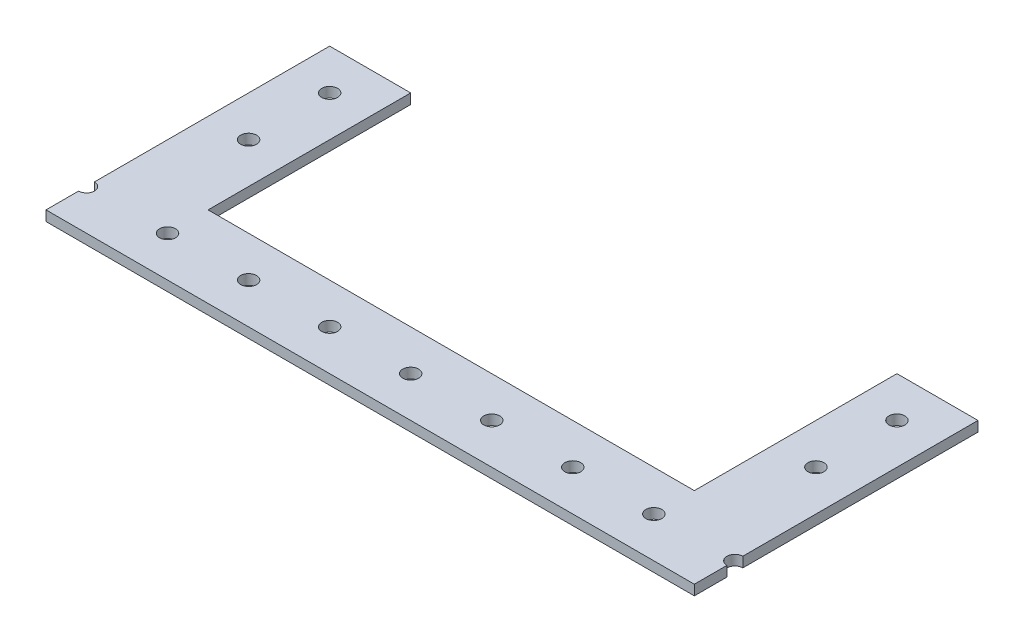
ISO-10303-21;
HEADER;
FILE_DESCRIPTION(('STEP AP214'),'2;1');
FILE_NAME('part.step','',(''),(''),'','','');
FILE_SCHEMA(('AUTOMOTIVE_DESIGN { 1 0 10303 214 1 1 1 1 }'));
ENDSEC;
DATA;
#1=APPLICATION_CONTEXT('core data for automotive mechanical design processes');
#2=APPLICATION_PROTOCOL_DEFINITION('international standard','automotive_design',2000,#1);
#3=PRODUCT_CONTEXT('',#1,'mechanical');
#4=PRODUCT('Part','Part','',(#3));
#5=PRODUCT_RELATED_PRODUCT_CATEGORY('part','',(#4));
#6=PRODUCT_DEFINITION_FORMATION('','',#4);
#7=PRODUCT_DEFINITION_CONTEXT('part definition',#1,'design');
#8=PRODUCT_DEFINITION('design','',#6,#7);
#9=PRODUCT_DEFINITION_SHAPE('','',#8);
#10=(LENGTH_UNIT() NAMED_UNIT(*) SI_UNIT(.MILLI.,.METRE.));
#11=(NAMED_UNIT(*) PLANE_ANGLE_UNIT() SI_UNIT($,.RADIAN.));
#12=(NAMED_UNIT(*) SI_UNIT($,.STERADIAN.) SOLID_ANGLE_UNIT());
#13=UNCERTAINTY_MEASURE_WITH_UNIT(LENGTH_MEASURE(1.E-05),#10,'distance_accuracy_value','');
#14=(GEOMETRIC_REPRESENTATION_CONTEXT(3) GLOBAL_UNCERTAINTY_ASSIGNED_CONTEXT((#13)) GLOBAL_UNIT_ASSIGNED_CONTEXT((#10,
#11,#12)) REPRESENTATION_CONTEXT('',''));
#15=CARTESIAN_POINT('',(0.,0.,0.));
#16=DIRECTION('',(0.,0.,1.));
#17=DIRECTION('',(1.,0.,0.));
#18=AXIS2_PLACEMENT_3D('',#15,#16,#17);
#19=CARTESIAN_POINT('',(101.6,3.175,-12.7));
#20=DIRECTION('',(0.,-1.,0.));
#21=DIRECTION('',(0.,0.,-1.));
#22=AXIS2_PLACEMENT_3D('',#19,#20,#21);
#23=CYLINDRICAL_SURFACE('',#22,2.48920000000003);
#24=CARTESIAN_POINT('',(101.6,0.,-12.7));
#25=DIRECTION('',(0.,1.,0.));
#26=DIRECTION('',(0.,0.,1.));
#27=AXIS2_PLACEMENT_3D('',#24,#25,#26);
#28=CIRCLE('',#27,2.48920000000003);
#29=CARTESIAN_POINT('',(101.6,0.,-15.1892));
#30=VERTEX_POINT('',#29);
#31=CARTESIAN_POINT('',(101.6,0.,-10.2108));
#32=VERTEX_POINT('',#31);
#33=EDGE_CURVE('E176',#30,#32,#28,.T.);
#34=ORIENTED_EDGE('',*,*,#33,.F.);
#35=DIRECTION('',(0.,-1.,0.));
#36=VECTOR('',#35,1.);
#37=CARTESIAN_POINT('',(101.6,3.175,-15.1892));
#38=LINE('',#37,#36);
#39=CARTESIAN_POINT('',(101.6,3.175,-15.1892));
#40=VERTEX_POINT('',#39);
#41=EDGE_CURVE('E11',#40,#30,#38,.T.);
#42=ORIENTED_EDGE('',*,*,#41,.F.);
#43=CARTESIAN_POINT('',(101.6,3.175,-12.7));
#44=DIRECTION('',(0.,1.,0.));
#45=DIRECTION('',(0.,0.,1.));
#46=AXIS2_PLACEMENT_3D('',#43,#44,#45);
#47=CIRCLE('',#46,2.48920000000003);
#48=CARTESIAN_POINT('',(101.6,3.175,-10.2108));
#49=VERTEX_POINT('',#48);
#50=EDGE_CURVE('E221',#40,#49,#47,.T.);
#51=ORIENTED_EDGE('',*,*,#50,.T.);
#52=DIRECTION('',(0.,-1.,0.));
#53=VECTOR('',#52,1.);
#54=CARTESIAN_POINT('',(101.6,3.175,-10.2108));
#55=LINE('',#54,#53);
#56=EDGE_CURVE('E99',#49,#32,#55,.T.);
#57=ORIENTED_EDGE('',*,*,#56,.T.);
#58=EDGE_LOOP('',(#34,#42,#51,#57));
#59=FACE_BOUND('',#58,.T.);
#60=ADVANCED_FACE('F36',(#59),#23,.F.);
#61=CARTESIAN_POINT('',(101.6,3.175,0.));
#62=DIRECTION('',(-1.,0.,0.));
#63=DIRECTION('',(0.,0.,1.));
#64=AXIS2_PLACEMENT_3D('',#61,#62,#63);
#65=PLANE('',#64);
#66=DIRECTION('',(0.,0.,-1.));
#67=VECTOR('',#66,1.);
#68=CARTESIAN_POINT('',(101.6,0.,0.));
#69=LINE('',#68,#67);
#70=CARTESIAN_POINT('',(101.6,0.,-88.9));
#71=VERTEX_POINT('',#70);
#72=EDGE_CURVE('E179',#30,#71,#69,.T.);
#73=ORIENTED_EDGE('',*,*,#72,.T.);
#74=DIRECTION('',(0.,-1.,0.));
#75=VECTOR('',#74,1.);
#76=CARTESIAN_POINT('',(101.6,3.175,-88.9));
#77=LINE('',#76,#75);
#78=CARTESIAN_POINT('',(101.6,3.175,-88.9));
#79=VERTEX_POINT('',#78);
#80=EDGE_CURVE('E44',#79,#71,#77,.T.);
#81=ORIENTED_EDGE('',*,*,#80,.F.);
#82=DIRECTION('',(0.,0.,-1.));
#83=VECTOR('',#82,1.);
#84=CARTESIAN_POINT('',(101.6,3.175,0.));
#85=LINE('',#84,#83);
#86=EDGE_CURVE('E153',#40,#79,#85,.T.);
#87=ORIENTED_EDGE('',*,*,#86,.F.);
#88=ORIENTED_EDGE('',*,*,#41,.T.);
#89=EDGE_LOOP('',(#73,#81,#87,#88));
#90=FACE_BOUND('',#89,.T.);
#91=ADVANCED_FACE('F288',(#90),#65,.F.);
#92=CARTESIAN_POINT('',(0.,3.175,-88.9));
#93=DIRECTION('',(0.,0.,1.));
#94=DIRECTION('',(1.,0.,0.));
#95=AXIS2_PLACEMENT_3D('',#92,#93,#94);
#96=PLANE('',#95);
#97=DIRECTION('',(-1.,0.,0.));
#98=VECTOR('',#97,1.);
#99=CARTESIAN_POINT('',(0.,0.,-88.9));
#100=LINE('',#99,#98);
#101=CARTESIAN_POINT('',(76.2,0.,-88.9));
#102=VERTEX_POINT('',#101);
#103=EDGE_CURVE('E182',#71,#102,#100,.T.);
#104=ORIENTED_EDGE('',*,*,#103,.T.);
#105=DIRECTION('',(0.,-1.,0.));
#106=VECTOR('',#105,1.);
#107=CARTESIAN_POINT('',(76.2,3.175,-88.9));
#108=LINE('',#107,#106);
#109=CARTESIAN_POINT('',(76.2,3.175,-88.9));
#110=VERTEX_POINT('',#109);
#111=EDGE_CURVE('E239',#110,#102,#108,.T.);
#112=ORIENTED_EDGE('',*,*,#111,.F.);
#113=DIRECTION('',(-1.,0.,0.));
#114=VECTOR('',#113,1.);
#115=CARTESIAN_POINT('',(0.,3.175,-88.9));
#116=LINE('',#115,#114);
#117=EDGE_CURVE('E248',#79,#110,#116,.T.);
#118=ORIENTED_EDGE('',*,*,#117,.F.);
#119=ORIENTED_EDGE('',*,*,#80,.T.);
#120=EDGE_LOOP('',(#104,#112,#118,#119));
#121=FACE_BOUND('',#120,.T.);
#122=ADVANCED_FACE('F246',(#121),#96,.F.);
#123=CARTESIAN_POINT('',(76.2,3.175,0.));
#124=DIRECTION('',(1.,0.,0.));
#125=DIRECTION('',(0.,0.,-1.));
#126=AXIS2_PLACEMENT_3D('',#123,#124,#125);
#127=PLANE('',#126);
#128=DIRECTION('',(0.,0.,1.));
#129=VECTOR('',#128,1.);
#130=CARTESIAN_POINT('',(76.2,0.,0.));
#131=LINE('',#130,#129);
#132=CARTESIAN_POINT('',(76.2,0.,-25.4));
#133=VERTEX_POINT('',#132);
#134=EDGE_CURVE('E185',#102,#133,#131,.T.);
#135=ORIENTED_EDGE('',*,*,#134,.T.);
#136=DIRECTION('',(0.,-1.,0.));
#137=VECTOR('',#136,1.);
#138=CARTESIAN_POINT('',(76.2,3.175,-25.4));
#139=LINE('',#138,#137);
#140=CARTESIAN_POINT('',(76.2,3.175,-25.4));
#141=VERTEX_POINT('',#140);
#142=EDGE_CURVE('E236',#141,#133,#139,.T.);
#143=ORIENTED_EDGE('',*,*,#142,.F.);
#144=DIRECTION('',(0.,0.,1.));
#145=VECTOR('',#144,1.);
#146=CARTESIAN_POINT('',(76.2,3.175,0.));
#147=LINE('',#146,#145);
#148=EDGE_CURVE('E268',#110,#141,#147,.T.);
#149=ORIENTED_EDGE('',*,*,#148,.F.);
#150=ORIENTED_EDGE('',*,*,#111,.T.);
#151=EDGE_LOOP('',(#135,#143,#149,#150));
#152=FACE_BOUND('',#151,.T.);
#153=ADVANCED_FACE('F259',(#152),#127,.F.);
#154=CARTESIAN_POINT('',(0.,3.175,-25.4));
#155=DIRECTION('',(0.,0.,1.));
#156=DIRECTION('',(1.,0.,0.));
#157=AXIS2_PLACEMENT_3D('',#154,#155,#156);
#158=PLANE('',#157);
#159=DIRECTION('',(-1.,0.,0.));
#160=VECTOR('',#159,1.);
#161=CARTESIAN_POINT('',(0.,0.,-25.4));
#162=LINE('',#161,#160);
#163=CARTESIAN_POINT('',(-76.2,0.,-25.4));
#164=VERTEX_POINT('',#163);
#165=EDGE_CURVE('E187',#133,#164,#162,.T.);
#166=ORIENTED_EDGE('',*,*,#165,.T.);
#167=DIRECTION('',(0.,-1.,0.));
#168=VECTOR('',#167,1.);
#169=CARTESIAN_POINT('',(-76.2,3.175,-25.4));
#170=LINE('',#169,#168);
#171=CARTESIAN_POINT('',(-76.2,3.175,-25.4));
#172=VERTEX_POINT('',#171);
#173=EDGE_CURVE('E233',#172,#164,#170,.T.);
#174=ORIENTED_EDGE('',*,*,#173,.F.);
#175=DIRECTION('',(-1.,0.,0.));
#176=VECTOR('',#175,1.);
#177=CARTESIAN_POINT('',(0.,3.175,-25.4));
#178=LINE('',#177,#176);
#179=EDGE_CURVE('E265',#141,#172,#178,.T.);
#180=ORIENTED_EDGE('',*,*,#179,.F.);
#181=ORIENTED_EDGE('',*,*,#142,.T.);
#182=EDGE_LOOP('',(#166,#174,#180,#181));
#183=FACE_BOUND('',#182,.T.);
#184=ADVANCED_FACE('F263',(#183),#158,.F.);
#185=CARTESIAN_POINT('',(-76.2,3.175,0.));
#186=DIRECTION('',(-1.,0.,0.));
#187=DIRECTION('',(0.,0.,1.));
#188=AXIS2_PLACEMENT_3D('',#185,#186,#187);
#189=PLANE('',#188);
#190=DIRECTION('',(0.,0.,-1.));
#191=VECTOR('',#190,1.);
#192=CARTESIAN_POINT('',(-76.2,0.,0.));
#193=LINE('',#192,#191);
#194=CARTESIAN_POINT('',(-76.2,0.,-88.9));
#195=VERTEX_POINT('',#194);
#196=EDGE_CURVE('E189',#164,#195,#193,.T.);
#197=ORIENTED_EDGE('',*,*,#196,.T.);
#198=DIRECTION('',(0.,-1.,0.));
#199=VECTOR('',#198,1.);
#200=CARTESIAN_POINT('',(-76.2,3.175,-88.9));
#201=LINE('',#200,#199);
#202=CARTESIAN_POINT('',(-76.2,3.175,-88.9));
#203=VERTEX_POINT('',#202);
#204=EDGE_CURVE('E230',#203,#195,#201,.T.);
#205=ORIENTED_EDGE('',*,*,#204,.F.);
#206=DIRECTION('',(0.,0.,-1.));
#207=VECTOR('',#206,1.);
#208=CARTESIAN_POINT('',(-76.2,3.175,0.));
#209=LINE('',#208,#207);
#210=EDGE_CURVE('E267',#172,#203,#209,.T.);
#211=ORIENTED_EDGE('',*,*,#210,.F.);
#212=ORIENTED_EDGE('',*,*,#173,.T.);
#213=EDGE_LOOP('',(#197,#205,#211,#212));
#214=FACE_BOUND('',#213,.T.);
#215=ADVANCED_FACE('F497',(#214),#189,.F.);
#216=CARTESIAN_POINT('',(0.,3.175,-88.9));
#217=DIRECTION('',(0.,0.,1.));
#218=DIRECTION('',(1.,0.,0.));
#219=AXIS2_PLACEMENT_3D('',#216,#217,#218);
#220=PLANE('',#219);
#221=DIRECTION('',(-1.,0.,0.));
#222=VECTOR('',#221,1.);
#223=CARTESIAN_POINT('',(0.,0.,-88.9));
#224=LINE('',#223,#222);
#225=CARTESIAN_POINT('',(-101.6,0.,-88.9));
#226=VERTEX_POINT('',#225);
#227=EDGE_CURVE('E191',#195,#226,#224,.T.);
#228=ORIENTED_EDGE('',*,*,#227,.T.);
#229=DIRECTION('',(0.,-1.,0.));
#230=VECTOR('',#229,1.);
#231=CARTESIAN_POINT('',(-101.6,3.175,-88.9));
#232=LINE('',#231,#230);
#233=CARTESIAN_POINT('',(-101.6,3.175,-88.9));
#234=VERTEX_POINT('',#233);
#235=EDGE_CURVE('E227',#234,#226,#232,.T.);
#236=ORIENTED_EDGE('',*,*,#235,.F.);
#237=DIRECTION('',(-1.,0.,0.));
#238=VECTOR('',#237,1.);
#239=CARTESIAN_POINT('',(0.,3.175,-88.9));
#240=LINE('',#239,#238);
#241=EDGE_CURVE('E270',#203,#234,#240,.T.);
#242=ORIENTED_EDGE('',*,*,#241,.F.);
#243=ORIENTED_EDGE('',*,*,#204,.T.);
#244=EDGE_LOOP('',(#228,#236,#242,#243));
#245=FACE_BOUND('',#244,.T.);
#246=ADVANCED_FACE('F489',(#245),#220,.F.);
#247=CARTESIAN_POINT('',(-101.6,3.175,0.));
#248=DIRECTION('',(1.,0.,0.));
#249=DIRECTION('',(0.,0.,-1.));
#250=AXIS2_PLACEMENT_3D('',#247,#248,#249);
#251=PLANE('',#250);
#252=DIRECTION('',(0.,0.,1.));
#253=VECTOR('',#252,1.);
#254=CARTESIAN_POINT('',(-101.6,0.,0.));
#255=LINE('',#254,#253);
#256=CARTESIAN_POINT('',(-101.6,0.,-15.1892));
#257=VERTEX_POINT('',#256);
#258=EDGE_CURVE('E193',#226,#257,#255,.T.);
#259=ORIENTED_EDGE('',*,*,#258,.T.);
#260=DIRECTION('',(0.,-1.,0.));
#261=VECTOR('',#260,1.);
#262=CARTESIAN_POINT('',(-101.6,3.175,-15.1892));
#263=LINE('',#262,#261);
#264=CARTESIAN_POINT('',(-101.6,3.175,-15.1892));
#265=VERTEX_POINT('',#264);
#266=EDGE_CURVE('E225',#265,#257,#263,.T.);
#267=ORIENTED_EDGE('',*,*,#266,.F.);
#268=DIRECTION('',(0.,0.,1.));
#269=VECTOR('',#268,1.);
#270=CARTESIAN_POINT('',(-101.6,3.175,0.));
#271=LINE('',#270,#269);
#272=EDGE_CURVE('E141',#234,#265,#271,.T.);
#273=ORIENTED_EDGE('',*,*,#272,.F.);
#274=ORIENTED_EDGE('',*,*,#235,.T.);
#275=EDGE_LOOP('',(#259,#267,#273,#274));
#276=FACE_BOUND('',#275,.T.);
#277=ADVANCED_FACE('F475',(#276),#251,.F.);
#278=CARTESIAN_POINT('',(-101.6,3.175,-12.7));
#279=DIRECTION('',(0.,-1.,0.));
#280=DIRECTION('',(0.,0.,-1.));
#281=AXIS2_PLACEMENT_3D('',#278,#279,#280);
#282=CYLINDRICAL_SURFACE('',#281,2.48920000000003);
#283=CARTESIAN_POINT('',(-101.6,0.,-12.7));
#284=DIRECTION('',(0.,1.,0.));
#285=DIRECTION('',(0.,0.,1.));
#286=AXIS2_PLACEMENT_3D('',#283,#284,#285);
#287=CIRCLE('',#286,2.48920000000003);
#288=CARTESIAN_POINT('',(-101.6,0.,-10.2108));
#289=VERTEX_POINT('',#288);
#290=EDGE_CURVE('E196',#289,#257,#287,.T.);
#291=ORIENTED_EDGE('',*,*,#290,.F.);
#292=DIRECTION('',(0.,-1.,0.));
#293=VECTOR('',#292,1.);
#294=CARTESIAN_POINT('',(-101.6,3.175,-10.2108));
#295=LINE('',#294,#293);
#296=CARTESIAN_POINT('',(-101.6,3.175,-10.2108));
#297=VERTEX_POINT('',#296);
#298=EDGE_CURVE('E146',#297,#289,#295,.T.);
#299=ORIENTED_EDGE('',*,*,#298,.F.);
#300=CARTESIAN_POINT('',(-101.6,3.175,-12.7));
#301=DIRECTION('',(0.,1.,0.));
#302=DIRECTION('',(0.,0.,1.));
#303=AXIS2_PLACEMENT_3D('',#300,#301,#302);
#304=CIRCLE('',#303,2.48920000000003);
#305=EDGE_CURVE('E138',#297,#265,#304,.T.);
#306=ORIENTED_EDGE('',*,*,#305,.T.);
#307=ORIENTED_EDGE('',*,*,#266,.T.);
#308=EDGE_LOOP('',(#291,#299,#306,#307));
#309=FACE_BOUND('',#308,.T.);
#310=ADVANCED_FACE('F279',(#309),#282,.F.);
#311=CARTESIAN_POINT('',(-101.6,0.,0.));
#312=VERTEX_POINT('',#311);
#313=EDGE_CURVE('E145',#289,#312,#255,.T.);
#314=ORIENTED_EDGE('',*,*,#313,.T.);
#315=DIRECTION('',(0.,-1.,0.));
#316=VECTOR('',#315,1.);
#317=CARTESIAN_POINT('',(-101.6,3.175,0.));
#318=LINE('',#317,#316);
#319=CARTESIAN_POINT('',(-101.6,3.175,0.));
#320=VERTEX_POINT('',#319);
#321=EDGE_CURVE('E142',#320,#312,#318,.T.);
#322=ORIENTED_EDGE('',*,*,#321,.F.);
#323=EDGE_CURVE('E131',#297,#320,#271,.T.);
#324=ORIENTED_EDGE('',*,*,#323,.F.);
#325=ORIENTED_EDGE('',*,*,#298,.T.);
#326=EDGE_LOOP('',(#314,#322,#324,#325));
#327=FACE_BOUND('',#326,.T.);
#328=ADVANCED_FACE('F143',(#327),#251,.F.);
#329=CARTESIAN_POINT('',(0.,3.175,0.));
#330=DIRECTION('',(0.,0.,-1.));
#331=DIRECTION('',(-1.,0.,0.));
#332=AXIS2_PLACEMENT_3D('',#329,#330,#331);
#333=PLANE('',#332);
#334=DIRECTION('',(1.,0.,0.));
#335=VECTOR('',#334,1.);
#336=CARTESIAN_POINT('',(0.,0.,0.));
#337=LINE('',#336,#335);
#338=CARTESIAN_POINT('',(101.6,0.,0.));
#339=VERTEX_POINT('',#338);
#340=EDGE_CURVE('E92',#312,#339,#337,.T.);
#341=ORIENTED_EDGE('',*,*,#340,.T.);
#342=DIRECTION('',(0.,-1.,0.));
#343=VECTOR('',#342,1.);
#344=CARTESIAN_POINT('',(101.6,3.175,0.));
#345=LINE('',#344,#343);
#346=CARTESIAN_POINT('',(101.6,3.175,0.));
#347=VERTEX_POINT('',#346);
#348=EDGE_CURVE('E147',#347,#339,#345,.T.);
#349=ORIENTED_EDGE('',*,*,#348,.F.);
#350=DIRECTION('',(1.,0.,0.));
#351=VECTOR('',#350,1.);
#352=CARTESIAN_POINT('',(0.,3.175,0.));
#353=LINE('',#352,#351);
#354=EDGE_CURVE('E136',#320,#347,#353,.T.);
#355=ORIENTED_EDGE('',*,*,#354,.F.);
#356=ORIENTED_EDGE('',*,*,#321,.T.);
#357=EDGE_LOOP('',(#341,#349,#355,#356));
#358=FACE_BOUND('',#357,.T.);
#359=ADVANCED_FACE('F149',(#358),#333,.F.);
#360=CARTESIAN_POINT('',(-50.8,3.175,-12.7));
#361=DIRECTION('',(0.,-1.,0.));
#362=DIRECTION('',(0.,0.,-1.));
#363=AXIS2_PLACEMENT_3D('',#360,#361,#362);
#364=CYLINDRICAL_SURFACE('',#363,2.4892);
#365=CARTESIAN_POINT('',(-50.8,3.175,-12.7));
#366=DIRECTION('',(0.,1.,0.));
#367=DIRECTION('',(0.,0.,1.));
#368=AXIS2_PLACEMENT_3D('',#365,#366,#367);
#369=CIRCLE('',#368,2.4892);
#370=CARTESIAN_POINT('',(-50.8,3.175,-10.2108));
#371=VERTEX_POINT('',#370);
#372=EDGE_CURVE('E170',#371,#371,#369,.T.);
#373=ORIENTED_EDGE('',*,*,#372,.T.);
#374=EDGE_LOOP('',(#373));
#375=FACE_BOUND('',#374,.T.);
#376=CARTESIAN_POINT('',(-50.8,0.,-12.7));
#377=DIRECTION('',(0.,1.,0.));
#378=DIRECTION('',(0.,0.,1.));
#379=AXIS2_PLACEMENT_3D('',#376,#377,#378);
#380=CIRCLE('',#379,2.4892);
#381=CARTESIAN_POINT('',(-50.8,0.,-10.2108));
#382=VERTEX_POINT('',#381);
#383=EDGE_CURVE('E215',#382,#382,#380,.T.);
#384=ORIENTED_EDGE('',*,*,#383,.F.);
#385=EDGE_LOOP('',(#384));
#386=FACE_BOUND('',#385,.T.);
#387=ADVANCED_FACE('F326',(#375,#386),#364,.F.);
#388=CARTESIAN_POINT('',(-25.4,3.175,-12.7));
#389=DIRECTION('',(0.,-1.,0.));
#390=DIRECTION('',(0.,0.,-1.));
#391=AXIS2_PLACEMENT_3D('',#388,#389,#390);
#392=CYLINDRICAL_SURFACE('',#391,2.4892);
#393=CARTESIAN_POINT('',(-25.4,3.175,-12.7));
#394=DIRECTION('',(0.,1.,0.));
#395=DIRECTION('',(0.,0.,1.));
#396=AXIS2_PLACEMENT_3D('',#393,#394,#395);
#397=CIRCLE('',#396,2.4892);
#398=CARTESIAN_POINT('',(-25.4,3.175,-10.2108));
#399=VERTEX_POINT('',#398);
#400=EDGE_CURVE('E167',#399,#399,#397,.T.);
#401=ORIENTED_EDGE('',*,*,#400,.T.);
#402=EDGE_LOOP('',(#401));
#403=FACE_BOUND('',#402,.T.);
#404=CARTESIAN_POINT('',(-25.4,0.,-12.7));
#405=DIRECTION('',(0.,1.,0.));
#406=DIRECTION('',(0.,0.,1.));
#407=AXIS2_PLACEMENT_3D('',#404,#405,#406);
#408=CIRCLE('',#407,2.4892);
#409=CARTESIAN_POINT('',(-25.4,0.,-10.2108));
#410=VERTEX_POINT('',#409);
#411=EDGE_CURVE('E212',#410,#410,#408,.T.);
#412=ORIENTED_EDGE('',*,*,#411,.F.);
#413=EDGE_LOOP('',(#412));
#414=FACE_BOUND('',#413,.T.);
#415=ADVANCED_FACE('F322',(#403,#414),#392,.F.);
#416=CARTESIAN_POINT('',(0.,3.175,-12.7));
#417=DIRECTION('',(0.,-1.,0.));
#418=DIRECTION('',(0.,0.,-1.));
#419=AXIS2_PLACEMENT_3D('',#416,#417,#418);
#420=CYLINDRICAL_SURFACE('',#419,2.4892);
#421=CARTESIAN_POINT('',(0.,3.175,-12.7));
#422=DIRECTION('',(0.,1.,0.));
#423=DIRECTION('',(0.,0.,1.));
#424=AXIS2_PLACEMENT_3D('',#421,#422,#423);
#425=CIRCLE('',#424,2.4892);
#426=CARTESIAN_POINT('',(0.,3.175,-10.2108));
#427=VERTEX_POINT('',#426);
#428=EDGE_CURVE('E164',#427,#427,#425,.T.);
#429=ORIENTED_EDGE('',*,*,#428,.T.);
#430=EDGE_LOOP('',(#429));
#431=FACE_BOUND('',#430,.T.);
#432=CARTESIAN_POINT('',(0.,0.,-12.7));
#433=DIRECTION('',(0.,1.,0.));
#434=DIRECTION('',(0.,0.,1.));
#435=AXIS2_PLACEMENT_3D('',#432,#433,#434);
#436=CIRCLE('',#435,2.4892);
#437=CARTESIAN_POINT('',(0.,0.,-10.2108));
#438=VERTEX_POINT('',#437);
#439=EDGE_CURVE('E209',#438,#438,#436,.T.);
#440=ORIENTED_EDGE('',*,*,#439,.F.);
#441=EDGE_LOOP('',(#440));
#442=FACE_BOUND('',#441,.T.);
#443=ADVANCED_FACE('F318',(#431,#442),#420,.F.);
#444=CARTESIAN_POINT('',(25.4,3.175,-12.7));
#445=DIRECTION('',(0.,-1.,0.));
#446=DIRECTION('',(0.,0.,-1.));
#447=AXIS2_PLACEMENT_3D('',#444,#445,#446);
#448=CYLINDRICAL_SURFACE('',#447,2.4892);
#449=CARTESIAN_POINT('',(25.4,3.175,-12.7));
#450=DIRECTION('',(0.,1.,0.));
#451=DIRECTION('',(0.,0.,1.));
#452=AXIS2_PLACEMENT_3D('',#449,#450,#451);
#453=CIRCLE('',#452,2.4892);
#454=CARTESIAN_POINT('',(25.4,3.175,-10.2108));
#455=VERTEX_POINT('',#454);
#456=EDGE_CURVE('E161',#455,#455,#453,.T.);
#457=ORIENTED_EDGE('',*,*,#456,.T.);
#458=EDGE_LOOP('',(#457));
#459=FACE_BOUND('',#458,.T.);
#460=CARTESIAN_POINT('',(25.4,0.,-12.7));
#461=DIRECTION('',(0.,1.,0.));
#462=DIRECTION('',(0.,0.,1.));
#463=AXIS2_PLACEMENT_3D('',#460,#461,#462);
#464=CIRCLE('',#463,2.4892);
#465=CARTESIAN_POINT('',(25.4,0.,-10.2108));
#466=VERTEX_POINT('',#465);
#467=EDGE_CURVE('E206',#466,#466,#464,.T.);
#468=ORIENTED_EDGE('',*,*,#467,.F.);
#469=EDGE_LOOP('',(#468));
#470=FACE_BOUND('',#469,.T.);
#471=ADVANCED_FACE('F311',(#459,#470),#448,.F.);
#472=CARTESIAN_POINT('',(50.7999999999999,3.175,-12.7));
#473=DIRECTION('',(0.,-1.,0.));
#474=DIRECTION('',(0.,0.,-1.));
#475=AXIS2_PLACEMENT_3D('',#472,#473,#474);
#476=CYLINDRICAL_SURFACE('',#475,2.48920000000002);
#477=CARTESIAN_POINT('',(50.7999999999999,3.175,-12.7));
#478=DIRECTION('',(0.,1.,0.));
#479=DIRECTION('',(0.,0.,1.));
#480=AXIS2_PLACEMENT_3D('',#477,#478,#479);
#481=CIRCLE('',#480,2.48920000000002);
#482=CARTESIAN_POINT('',(50.7999999999999,3.175,-10.2108));
#483=VERTEX_POINT('',#482);
#484=EDGE_CURVE('E158',#483,#483,#481,.T.);
#485=ORIENTED_EDGE('',*,*,#484,.T.);
#486=EDGE_LOOP('',(#485));
#487=FACE_BOUND('',#486,.T.);
#488=CARTESIAN_POINT('',(50.7999999999999,0.,-12.7));
#489=DIRECTION('',(0.,1.,0.));
#490=DIRECTION('',(0.,0.,1.));
#491=AXIS2_PLACEMENT_3D('',#488,#489,#490);
#492=CIRCLE('',#491,2.48920000000002);
#493=CARTESIAN_POINT('',(50.7999999999999,0.,-10.2108));
#494=VERTEX_POINT('',#493);
#495=EDGE_CURVE('E203',#494,#494,#492,.T.);
#496=ORIENTED_EDGE('',*,*,#495,.F.);
#497=EDGE_LOOP('',(#496));
#498=FACE_BOUND('',#497,.T.);
#499=ADVANCED_FACE('F306',(#487,#498),#476,.F.);
#500=CARTESIAN_POINT('',(76.1999999999999,3.175,-12.7));
#501=DIRECTION('',(0.,-1.,0.));
#502=DIRECTION('',(0.,0.,-1.));
#503=AXIS2_PLACEMENT_3D('',#500,#501,#502);
#504=CYLINDRICAL_SURFACE('',#503,2.4892);
#505=CARTESIAN_POINT('',(76.1999999999999,3.175,-12.7));
#506=DIRECTION('',(0.,1.,0.));
#507=DIRECTION('',(0.,0.,1.));
#508=AXIS2_PLACEMENT_3D('',#505,#506,#507);
#509=CIRCLE('',#508,2.4892);
#510=CARTESIAN_POINT('',(76.1999999999999,3.175,-10.2108));
#511=VERTEX_POINT('',#510);
#512=EDGE_CURVE('E151',#511,#511,#509,.T.);
#513=ORIENTED_EDGE('',*,*,#512,.T.);
#514=EDGE_LOOP('',(#513));
#515=FACE_BOUND('',#514,.T.);
#516=CARTESIAN_POINT('',(76.1999999999999,0.,-12.7));
#517=DIRECTION('',(0.,1.,0.));
#518=DIRECTION('',(0.,0.,1.));
#519=AXIS2_PLACEMENT_3D('',#516,#517,#518);
#520=CIRCLE('',#519,2.4892);
#521=CARTESIAN_POINT('',(76.1999999999999,0.,-10.2108));
#522=VERTEX_POINT('',#521);
#523=EDGE_CURVE('E200',#522,#522,#520,.T.);
#524=ORIENTED_EDGE('',*,*,#523,.F.);
#525=EDGE_LOOP('',(#524));
#526=FACE_BOUND('',#525,.T.);
#527=ADVANCED_FACE('F299',(#515,#526),#504,.F.);
#528=EDGE_CURVE('E183',#339,#32,#69,.T.);
#529=ORIENTED_EDGE('',*,*,#528,.T.);
#530=ORIENTED_EDGE('',*,*,#56,.F.);
#531=EDGE_CURVE('E52',#347,#49,#85,.T.);
#532=ORIENTED_EDGE('',*,*,#531,.F.);
#533=ORIENTED_EDGE('',*,*,#348,.T.);
#534=EDGE_LOOP('',(#529,#530,#532,#533));
#535=FACE_BOUND('',#534,.T.);
#536=ADVANCED_FACE('F283',(#535),#65,.F.);
#537=CARTESIAN_POINT('',(-76.2,3.175,-12.7));
#538=DIRECTION('',(0.,-1.,0.));
#539=DIRECTION('',(0.,0.,-1.));
#540=AXIS2_PLACEMENT_3D('',#537,#538,#539);
#541=CYLINDRICAL_SURFACE('',#540,2.4892);
#542=CARTESIAN_POINT('',(-76.2,3.175,-12.7));
#543=DIRECTION('',(0.,1.,0.));
#544=DIRECTION('',(0.,0.,1.));
#545=AXIS2_PLACEMENT_3D('',#542,#543,#544);
#546=CIRCLE('',#545,2.4892);
#547=CARTESIAN_POINT('',(-76.2,3.175,-10.2108));
#548=VERTEX_POINT('',#547);
#549=EDGE_CURVE('E173',#548,#548,#546,.T.);
#550=ORIENTED_EDGE('',*,*,#549,.T.);
#551=EDGE_LOOP('',(#550));
#552=FACE_BOUND('',#551,.T.);
#553=CARTESIAN_POINT('',(-76.2,0.,-12.7));
#554=DIRECTION('',(0.,1.,0.));
#555=DIRECTION('',(0.,0.,1.));
#556=AXIS2_PLACEMENT_3D('',#553,#554,#555);
#557=CIRCLE('',#556,2.4892);
#558=CARTESIAN_POINT('',(-76.2,0.,-10.2108));
#559=VERTEX_POINT('',#558);
#560=EDGE_CURVE('E218',#559,#559,#557,.T.);
#561=ORIENTED_EDGE('',*,*,#560,.F.);
#562=EDGE_LOOP('',(#561));
#563=FACE_BOUND('',#562,.T.);
#564=ADVANCED_FACE('F298',(#552,#563),#541,.F.);
#565=CARTESIAN_POINT('',(0.,3.175,0.));
#566=DIRECTION('',(0.,1.,0.));
#567=DIRECTION('',(0.,0.,1.));
#568=AXIS2_PLACEMENT_3D('',#565,#566,#567);
#569=PLANE('',#568);
#570=CARTESIAN_POINT('',(88.9,3.175,-50.8));
#571=DIRECTION('',(0.,1.,0.));
#572=DIRECTION('',(0.,0.,1.));
#573=AXIS2_PLACEMENT_3D('',#570,#571,#572);
#574=CIRCLE('',#573,2.48920000000005);
#575=CARTESIAN_POINT('',(88.9,3.175,-48.3107999999999));
#576=VERTEX_POINT('',#575);
#577=EDGE_CURVE('E374',#576,#576,#574,.T.);
#578=ORIENTED_EDGE('',*,*,#577,.F.);
#579=EDGE_LOOP('',(#578));
#580=FACE_BOUND('',#579,.T.);
#581=CARTESIAN_POINT('',(88.9,3.175,-76.2));
#582=DIRECTION('',(0.,1.,0.));
#583=DIRECTION('',(0.,0.,1.));
#584=AXIS2_PLACEMENT_3D('',#581,#582,#583);
#585=CIRCLE('',#584,2.48920000000005);
#586=CARTESIAN_POINT('',(88.9,3.175,-73.7107999999999));
#587=VERTEX_POINT('',#586);
#588=EDGE_CURVE('E366',#587,#587,#585,.T.);
#589=ORIENTED_EDGE('',*,*,#588,.F.);
#590=EDGE_LOOP('',(#589));
#591=FACE_BOUND('',#590,.T.);
#592=CARTESIAN_POINT('',(-88.9,3.175,-76.2));
#593=DIRECTION('',(0.,1.,0.));
#594=DIRECTION('',(0.,0.,1.));
#595=AXIS2_PLACEMENT_3D('',#592,#593,#594);
#596=CIRCLE('',#595,2.4892);
#597=CARTESIAN_POINT('',(-88.9,3.175,-73.7108));
#598=VERTEX_POINT('',#597);
#599=EDGE_CURVE('E360',#598,#598,#596,.T.);
#600=ORIENTED_EDGE('',*,*,#599,.F.);
#601=EDGE_LOOP('',(#600));
#602=FACE_BOUND('',#601,.T.);
#603=CARTESIAN_POINT('',(-88.9,3.175,-50.7999999999999));
#604=DIRECTION('',(0.,1.,0.));
#605=DIRECTION('',(0.,0.,1.));
#606=AXIS2_PLACEMENT_3D('',#603,#604,#605);
#607=CIRCLE('',#606,2.4892);
#608=CARTESIAN_POINT('',(-88.9,3.175,-48.3107999999999));
#609=VERTEX_POINT('',#608);
#610=EDGE_CURVE('E286',#609,#609,#607,.T.);
#611=ORIENTED_EDGE('',*,*,#610,.F.);
#612=EDGE_LOOP('',(#611));
#613=FACE_BOUND('',#612,.T.);
#614=ORIENTED_EDGE('',*,*,#50,.F.);
#615=ORIENTED_EDGE('',*,*,#86,.T.);
#616=ORIENTED_EDGE('',*,*,#117,.T.);
#617=ORIENTED_EDGE('',*,*,#148,.T.);
#618=ORIENTED_EDGE('',*,*,#179,.T.);
#619=ORIENTED_EDGE('',*,*,#210,.T.);
#620=ORIENTED_EDGE('',*,*,#241,.T.);
#621=ORIENTED_EDGE('',*,*,#272,.T.);
#622=ORIENTED_EDGE('',*,*,#305,.F.);
#623=ORIENTED_EDGE('',*,*,#323,.T.);
#624=ORIENTED_EDGE('',*,*,#354,.T.);
#625=ORIENTED_EDGE('',*,*,#531,.T.);
#626=EDGE_LOOP('',(#614,#615,#616,#617,#618,#619,#620,#621,#622,#623,#624,#625));
#627=FACE_BOUND('',#626,.T.);
#628=ORIENTED_EDGE('',*,*,#512,.F.);
#629=EDGE_LOOP('',(#628));
#630=FACE_BOUND('',#629,.T.);
#631=ORIENTED_EDGE('',*,*,#484,.F.);
#632=EDGE_LOOP('',(#631));
#633=FACE_BOUND('',#632,.T.);
#634=ORIENTED_EDGE('',*,*,#456,.F.);
#635=EDGE_LOOP('',(#634));
#636=FACE_BOUND('',#635,.T.);
#637=ORIENTED_EDGE('',*,*,#428,.F.);
#638=EDGE_LOOP('',(#637));
#639=FACE_BOUND('',#638,.T.);
#640=ORIENTED_EDGE('',*,*,#400,.F.);
#641=EDGE_LOOP('',(#640));
#642=FACE_BOUND('',#641,.T.);
#643=ORIENTED_EDGE('',*,*,#372,.F.);
#644=EDGE_LOOP('',(#643));
#645=FACE_BOUND('',#644,.T.);
#646=ORIENTED_EDGE('',*,*,#549,.F.);
#647=EDGE_LOOP('',(#646));
#648=FACE_BOUND('',#647,.T.);
#649=ADVANCED_FACE('F133',(#580,#591,#602,#613,#627,#630,#633,#636,#639,#642,#645,#648),#569,.T.);
#650=CARTESIAN_POINT('',(0.,0.,0.));
#651=DIRECTION('',(0.,1.,0.));
#652=DIRECTION('',(0.,0.,1.));
#653=AXIS2_PLACEMENT_3D('',#650,#651,#652);
#654=PLANE('',#653);
#655=CARTESIAN_POINT('',(88.9,0.,-50.8));
#656=DIRECTION('',(0.,1.,0.));
#657=DIRECTION('',(0.,0.,1.));
#658=AXIS2_PLACEMENT_3D('',#655,#656,#657);
#659=CIRCLE('',#658,2.48920000000005);
#660=CARTESIAN_POINT('',(88.9,0.,-48.3107999999999));
#661=VERTEX_POINT('',#660);
#662=EDGE_CURVE('E371',#661,#661,#659,.T.);
#663=ORIENTED_EDGE('',*,*,#662,.T.);
#664=EDGE_LOOP('',(#663));
#665=FACE_BOUND('',#664,.T.);
#666=CARTESIAN_POINT('',(88.9,0.,-76.2));
#667=DIRECTION('',(0.,1.,0.));
#668=DIRECTION('',(0.,0.,1.));
#669=AXIS2_PLACEMENT_3D('',#666,#667,#668);
#670=CIRCLE('',#669,2.48920000000005);
#671=CARTESIAN_POINT('',(88.9,0.,-73.7107999999999));
#672=VERTEX_POINT('',#671);
#673=EDGE_CURVE('E362',#672,#672,#670,.T.);
#674=ORIENTED_EDGE('',*,*,#673,.T.);
#675=EDGE_LOOP('',(#674));
#676=FACE_BOUND('',#675,.T.);
#677=CARTESIAN_POINT('',(-88.9,0.,-76.2));
#678=DIRECTION('',(0.,1.,0.));
#679=DIRECTION('',(0.,0.,1.));
#680=AXIS2_PLACEMENT_3D('',#677,#678,#679);
#681=CIRCLE('',#680,2.4892);
#682=CARTESIAN_POINT('',(-88.9,0.,-73.7108));
#683=VERTEX_POINT('',#682);
#684=EDGE_CURVE('E357',#683,#683,#681,.T.);
#685=ORIENTED_EDGE('',*,*,#684,.T.);
#686=EDGE_LOOP('',(#685));
#687=FACE_BOUND('',#686,.T.);
#688=CARTESIAN_POINT('',(-88.9,0.,-50.7999999999999));
#689=DIRECTION('',(0.,1.,0.));
#690=DIRECTION('',(0.,0.,1.));
#691=AXIS2_PLACEMENT_3D('',#688,#689,#690);
#692=CIRCLE('',#691,2.4892);
#693=CARTESIAN_POINT('',(-88.9,0.,-48.3107999999999));
#694=VERTEX_POINT('',#693);
#695=EDGE_CURVE('E180',#694,#694,#692,.T.);
#696=ORIENTED_EDGE('',*,*,#695,.T.);
#697=EDGE_LOOP('',(#696));
#698=FACE_BOUND('',#697,.T.);
#699=ORIENTED_EDGE('',*,*,#33,.T.);
#700=ORIENTED_EDGE('',*,*,#528,.F.);
#701=ORIENTED_EDGE('',*,*,#340,.F.);
#702=ORIENTED_EDGE('',*,*,#313,.F.);
#703=ORIENTED_EDGE('',*,*,#290,.T.);
#704=ORIENTED_EDGE('',*,*,#258,.F.);
#705=ORIENTED_EDGE('',*,*,#227,.F.);
#706=ORIENTED_EDGE('',*,*,#196,.F.);
#707=ORIENTED_EDGE('',*,*,#165,.F.);
#708=ORIENTED_EDGE('',*,*,#134,.F.);
#709=ORIENTED_EDGE('',*,*,#103,.F.);
#710=ORIENTED_EDGE('',*,*,#72,.F.);
#711=EDGE_LOOP('',(#699,#700,#701,#702,#703,#704,#705,#706,#707,#708,#709,#710));
#712=FACE_BOUND('',#711,.T.);
#713=ORIENTED_EDGE('',*,*,#523,.T.);
#714=EDGE_LOOP('',(#713));
#715=FACE_BOUND('',#714,.T.);
#716=ORIENTED_EDGE('',*,*,#495,.T.);
#717=EDGE_LOOP('',(#716));
#718=FACE_BOUND('',#717,.T.);
#719=ORIENTED_EDGE('',*,*,#467,.T.);
#720=EDGE_LOOP('',(#719));
#721=FACE_BOUND('',#720,.T.);
#722=ORIENTED_EDGE('',*,*,#439,.T.);
#723=EDGE_LOOP('',(#722));
#724=FACE_BOUND('',#723,.T.);
#725=ORIENTED_EDGE('',*,*,#411,.T.);
#726=EDGE_LOOP('',(#725));
#727=FACE_BOUND('',#726,.T.);
#728=ORIENTED_EDGE('',*,*,#383,.T.);
#729=EDGE_LOOP('',(#728));
#730=FACE_BOUND('',#729,.T.);
#731=ORIENTED_EDGE('',*,*,#560,.T.);
#732=EDGE_LOOP('',(#731));
#733=FACE_BOUND('',#732,.T.);
#734=ADVANCED_FACE('F253',(#665,#676,#687,#698,#712,#715,#718,#721,#724,#727,#730,#733),#654,.F.);
#735=CARTESIAN_POINT('',(-88.9,0.,-50.7999999999999));
#736=DIRECTION('',(0.,1.,0.));
#737=DIRECTION('',(0.,0.,1.));
#738=AXIS2_PLACEMENT_3D('',#735,#736,#737);
#739=CYLINDRICAL_SURFACE('',#738,2.4892);
#740=ORIENTED_EDGE('',*,*,#695,.F.);
#741=EDGE_LOOP('',(#740));
#742=FACE_BOUND('',#741,.T.);
#743=ORIENTED_EDGE('',*,*,#610,.T.);
#744=EDGE_LOOP('',(#743));
#745=FACE_BOUND('',#744,.T.);
#746=ADVANCED_FACE('F333',(#742,#745),#739,.F.);
#747=CARTESIAN_POINT('',(-88.9,0.,-76.2));
#748=DIRECTION('',(0.,1.,0.));
#749=DIRECTION('',(0.,0.,1.));
#750=AXIS2_PLACEMENT_3D('',#747,#748,#749);
#751=CYLINDRICAL_SURFACE('',#750,2.4892);
#752=ORIENTED_EDGE('',*,*,#684,.F.);
#753=EDGE_LOOP('',(#752));
#754=FACE_BOUND('',#753,.T.);
#755=ORIENTED_EDGE('',*,*,#599,.T.);
#756=EDGE_LOOP('',(#755));
#757=FACE_BOUND('',#756,.T.);
#758=ADVANCED_FACE('F340',(#754,#757),#751,.F.);
#759=CARTESIAN_POINT('',(88.9,0.,-76.2));
#760=DIRECTION('',(0.,1.,0.));
#761=DIRECTION('',(0.,0.,1.));
#762=AXIS2_PLACEMENT_3D('',#759,#760,#761);
#763=CYLINDRICAL_SURFACE('',#762,2.48920000000005);
#764=ORIENTED_EDGE('',*,*,#673,.F.);
#765=EDGE_LOOP('',(#764));
#766=FACE_BOUND('',#765,.T.);
#767=ORIENTED_EDGE('',*,*,#588,.T.);
#768=EDGE_LOOP('',(#767));
#769=FACE_BOUND('',#768,.T.);
#770=ADVANCED_FACE('F345',(#766,#769),#763,.F.);
#771=CARTESIAN_POINT('',(88.9,0.,-50.8));
#772=DIRECTION('',(0.,1.,0.));
#773=DIRECTION('',(0.,0.,1.));
#774=AXIS2_PLACEMENT_3D('',#771,#772,#773);
#775=CYLINDRICAL_SURFACE('',#774,2.48920000000005);
#776=ORIENTED_EDGE('',*,*,#662,.F.);
#777=EDGE_LOOP('',(#776));
#778=FACE_BOUND('',#777,.T.);
#779=ORIENTED_EDGE('',*,*,#577,.T.);
#780=EDGE_LOOP('',(#779));
#781=FACE_BOUND('',#780,.T.);
#782=ADVANCED_FACE('F342',(#778,#781),#775,.F.);
#783=CLOSED_SHELL('',(#60,#91,#122,#153,#184,#215,#246,#277,#310,#328,#359,#387,#415,#443,#471,
#499,#527,#536,#564,#649,#734,#746,#758,#770,#782));
#784=MANIFOLD_SOLID_BREP('B2',#783);
#785=ADVANCED_BREP_SHAPE_REPRESENTATION('',(#18,#784),#14);
#786=SHAPE_DEFINITION_REPRESENTATION(#9,#785);
ENDSEC;
END-ISO-10303-21;
